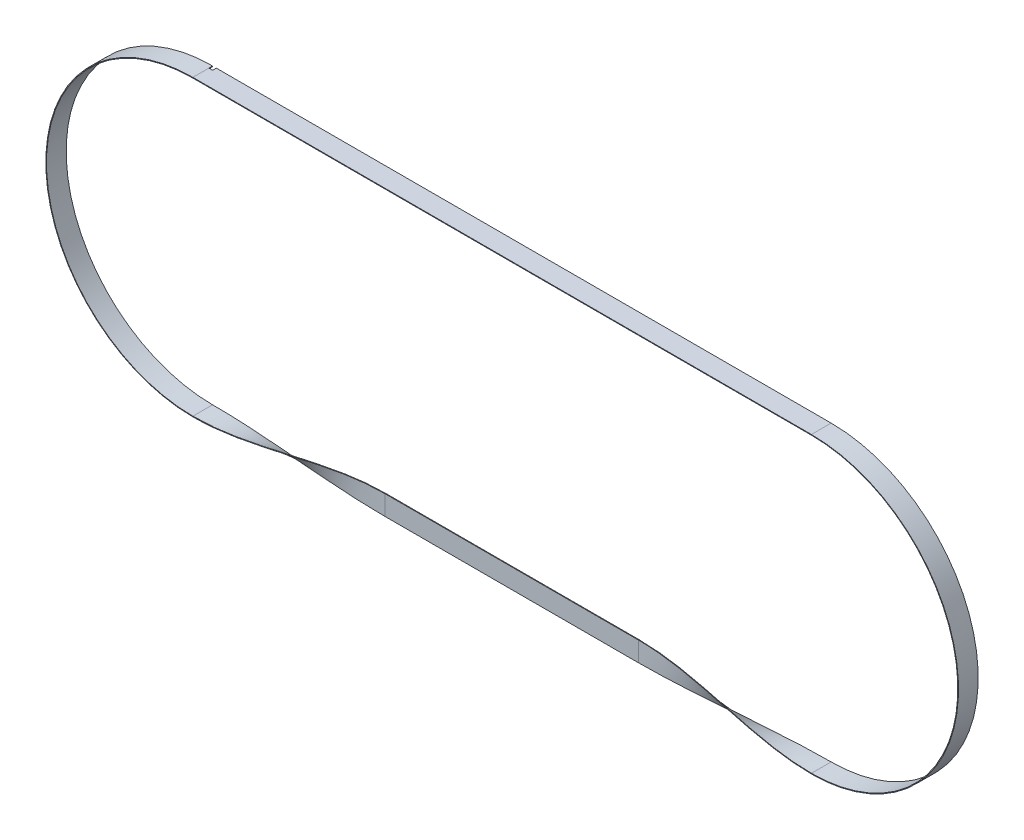
ISO-10303-21;
HEADER;
FILE_DESCRIPTION(('STEP AP214'),'2;1');
FILE_NAME('part.step','',(''),(''),'','','');
FILE_SCHEMA(('AUTOMOTIVE_DESIGN { 1 0 10303 214 1 1 1 1 }'));
ENDSEC;
DATA;
#1=APPLICATION_CONTEXT('core data for automotive mechanical design processes');
#2=APPLICATION_PROTOCOL_DEFINITION('international standard','automotive_design',2000,#1);
#3=PRODUCT_CONTEXT('',#1,'mechanical');
#4=PRODUCT('Part','Part','',(#3));
#5=PRODUCT_RELATED_PRODUCT_CATEGORY('part','',(#4));
#6=PRODUCT_DEFINITION_FORMATION('','',#4);
#7=PRODUCT_DEFINITION_CONTEXT('part definition',#1,'design');
#8=PRODUCT_DEFINITION('design','',#6,#7);
#9=PRODUCT_DEFINITION_SHAPE('','',#8);
#10=(LENGTH_UNIT() NAMED_UNIT(*) SI_UNIT(.MILLI.,.METRE.));
#11=(NAMED_UNIT(*) PLANE_ANGLE_UNIT() SI_UNIT($,.RADIAN.));
#12=(NAMED_UNIT(*) SI_UNIT($,.STERADIAN.) SOLID_ANGLE_UNIT());
#13=UNCERTAINTY_MEASURE_WITH_UNIT(LENGTH_MEASURE(1.E-05),#10,'distance_accuracy_value','');
#14=(GEOMETRIC_REPRESENTATION_CONTEXT(3) GLOBAL_UNCERTAINTY_ASSIGNED_CONTEXT((#13)) GLOBAL_UNIT_ASSIGNED_CONTEXT((#10,
#11,#12)) REPRESENTATION_CONTEXT('',''));
#15=CARTESIAN_POINT('',(0.,0.,0.));
#16=DIRECTION('',(0.,0.,1.));
#17=DIRECTION('',(1.,0.,0.));
#18=AXIS2_PLACEMENT_3D('',#15,#16,#17);
#19=CARTESIAN_POINT('',(423.499999999997,200.45,13.4999999999996));
#20=DIRECTION('',(0.,-1.,0.));
#21=DIRECTION('',(0.,0.,-1.));
#22=AXIS2_PLACEMENT_3D('',#19,#20,#21);
#23=PLANE('',#22);
#24=DIRECTION('',(0.,0.,1.));
#25=VECTOR('',#24,1.);
#26=CARTESIAN_POINT('',(-423.500000000003,200.45,13.4999999999996));
#27=LINE('',#26,#25);
#28=CARTESIAN_POINT('',(-423.499999999999,200.45,-8.40000000000041));
#29=VERTEX_POINT('',#28);
#30=CARTESIAN_POINT('',(-423.500000000003,200.45,13.4999999999996));
#31=VERTEX_POINT('',#30);
#32=EDGE_CURVE('E411',#29,#31,#27,.T.);
#33=ORIENTED_EDGE('',*,*,#32,.F.);
#34=DIRECTION('',(1.,0.,0.));
#35=VECTOR('',#34,1.);
#36=CARTESIAN_POINT('',(423.499999999997,200.45,-8.40000000000416));
#37=LINE('',#36,#35);
#38=CARTESIAN_POINT('',(-418.399999999999,200.45,-8.40000000000043));
#39=VERTEX_POINT('',#38);
#40=EDGE_CURVE('E468',#29,#39,#37,.T.);
#41=ORIENTED_EDGE('',*,*,#40,.T.);
#42=DIRECTION('',(0.,0.,-1.));
#43=VECTOR('',#42,1.);
#44=CARTESIAN_POINT('',(-418.399999999999,200.45,13.4999999999996));
#45=LINE('',#44,#43);
#46=CARTESIAN_POINT('',(-418.399999999999,200.45,-13.5000000000004));
#47=VERTEX_POINT('',#46);
#48=EDGE_CURVE('E669',#39,#47,#45,.T.);
#49=ORIENTED_EDGE('',*,*,#48,.T.);
#50=DIRECTION('',(-1.,0.,0.));
#51=VECTOR('',#50,1.);
#52=CARTESIAN_POINT('',(423.499999999997,200.45,-13.5000000000004));
#53=LINE('',#52,#51);
#54=CARTESIAN_POINT('',(423.499999999997,200.45,-13.5000000000004));
#55=VERTEX_POINT('',#54);
#56=EDGE_CURVE('E289',#55,#47,#53,.T.);
#57=ORIENTED_EDGE('',*,*,#56,.F.);
#58=DIRECTION('',(0.,0.,1.));
#59=VECTOR('',#58,1.);
#60=CARTESIAN_POINT('',(423.499999999997,200.45,13.4999999999996));
#61=LINE('',#60,#59);
#62=CARTESIAN_POINT('',(423.499999999997,200.45,13.4999999999996));
#63=VERTEX_POINT('',#62);
#64=EDGE_CURVE('E337',#55,#63,#61,.T.);
#65=ORIENTED_EDGE('',*,*,#64,.T.);
#66=DIRECTION('',(-1.,0.,0.));
#67=VECTOR('',#66,1.);
#68=CARTESIAN_POINT('',(423.499999999997,200.45,13.4999999999996));
#69=LINE('',#68,#67);
#70=EDGE_CURVE('E401',#63,#31,#69,.T.);
#71=ORIENTED_EDGE('',*,*,#70,.T.);
#72=EDGE_LOOP('',(#33,#41,#49,#57,#65,#71));
#73=FACE_BOUND('',#72,.T.);
#74=ADVANCED_FACE('F167',(#73),#23,.T.);
#75=CARTESIAN_POINT('',(423.499999999997,201.35,13.4999999999996));
#76=DIRECTION('',(0.,1.,0.));
#77=DIRECTION('',(0.,0.,1.));
#78=AXIS2_PLACEMENT_3D('',#75,#76,#77);
#79=PLANE('',#78);
#80=DIRECTION('',(0.,0.,1.));
#81=VECTOR('',#80,1.);
#82=CARTESIAN_POINT('',(-418.399999999999,201.35,13.4999999999996));
#83=LINE('',#82,#81);
#84=CARTESIAN_POINT('',(-418.399999999999,201.35,-13.5000000000004));
#85=VERTEX_POINT('',#84);
#86=CARTESIAN_POINT('',(-418.399999999999,201.35,-8.40000000000043));
#87=VERTEX_POINT('',#86);
#88=EDGE_CURVE('E182',#85,#87,#83,.T.);
#89=ORIENTED_EDGE('',*,*,#88,.T.);
#90=DIRECTION('',(-1.,0.,0.));
#91=VECTOR('',#90,1.);
#92=CARTESIAN_POINT('',(423.499999999997,201.35,-8.40000000000416));
#93=LINE('',#92,#91);
#94=CARTESIAN_POINT('',(-423.499999999999,201.35,-8.40000000000041));
#95=VERTEX_POINT('',#94);
#96=EDGE_CURVE('E12',#87,#95,#93,.T.);
#97=ORIENTED_EDGE('',*,*,#96,.T.);
#98=DIRECTION('',(0.,0.,-1.));
#99=VECTOR('',#98,1.);
#100=CARTESIAN_POINT('',(-423.500000000003,201.35,13.4999999999996));
#101=LINE('',#100,#99);
#102=CARTESIAN_POINT('',(-423.500000000003,201.35,13.4999999999996));
#103=VERTEX_POINT('',#102);
#104=EDGE_CURVE('E323',#103,#95,#101,.T.);
#105=ORIENTED_EDGE('',*,*,#104,.F.);
#106=DIRECTION('',(-1.,0.,0.));
#107=VECTOR('',#106,1.);
#108=CARTESIAN_POINT('',(423.499999999997,201.35,13.4999999999996));
#109=LINE('',#108,#107);
#110=CARTESIAN_POINT('',(423.499999999997,201.35,13.4999999999996));
#111=VERTEX_POINT('',#110);
#112=EDGE_CURVE('E404',#111,#103,#109,.T.);
#113=ORIENTED_EDGE('',*,*,#112,.F.);
#114=DIRECTION('',(0.,0.,-1.));
#115=VECTOR('',#114,1.);
#116=CARTESIAN_POINT('',(423.499999999997,201.35,13.4999999999996));
#117=LINE('',#116,#115);
#118=CARTESIAN_POINT('',(423.499999999997,201.35,-13.5000000000004));
#119=VERTEX_POINT('',#118);
#120=EDGE_CURVE('E319',#111,#119,#117,.T.);
#121=ORIENTED_EDGE('',*,*,#120,.T.);
#122=DIRECTION('',(-1.,0.,0.));
#123=VECTOR('',#122,1.);
#124=CARTESIAN_POINT('',(423.499999999997,201.35,-13.5000000000004));
#125=LINE('',#124,#123);
#126=EDGE_CURVE('E407',#119,#85,#125,.T.);
#127=ORIENTED_EDGE('',*,*,#126,.T.);
#128=EDGE_LOOP('',(#89,#97,#105,#113,#121,#127));
#129=FACE_BOUND('',#128,.T.);
#130=ADVANCED_FACE('F630',(#129),#79,.T.);
#131=CARTESIAN_POINT('',(423.499999999997,201.35,-13.5000000000004));
#132=DIRECTION('',(0.,0.,1.));
#133=DIRECTION('',(1.,0.,0.));
#134=AXIS2_PLACEMENT_3D('',#131,#132,#133);
#135=PLANE('',#134);
#136=DIRECTION('',(0.,1.,0.));
#137=VECTOR('',#136,1.);
#138=CARTESIAN_POINT('',(-423.499999999999,201.35,-13.5000000000004));
#139=LINE('',#138,#137);
#140=CARTESIAN_POINT('',(-423.499999999999,200.45,-13.5000000000004));
#141=VERTEX_POINT('',#140);
#142=CARTESIAN_POINT('',(-423.499999999999,201.35,-13.5000000000004));
#143=VERTEX_POINT('',#142);
#144=EDGE_CURVE('E175',#141,#143,#139,.T.);
#145=ORIENTED_EDGE('',*,*,#144,.F.);
#146=CARTESIAN_POINT('',(-423.5,0.,-13.5000000000004));
#147=DIRECTION('',(0.,0.,1.));
#148=DIRECTION('',(1.,0.,0.));
#149=AXIS2_PLACEMENT_3D('',#146,#147,#148);
#150=CIRCLE('',#149,200.45);
#151=CARTESIAN_POINT('',(-423.499999999999,-200.449999999999,-13.4999999999823));
#152=VERTEX_POINT('',#151);
#153=EDGE_CURVE('E285',#141,#152,#150,.T.);
#154=ORIENTED_EDGE('',*,*,#153,.T.);
#155=DIRECTION('',(0.,1.,0.));
#156=VECTOR('',#155,1.);
#157=CARTESIAN_POINT('',(-423.499999999997,201.35,-13.5000000000004));
#158=LINE('',#157,#156);
#159=CARTESIAN_POINT('',(-423.499999999999,-201.349999999999,-13.5000000000004));
#160=VERTEX_POINT('',#159);
#161=EDGE_CURVE('E282',#160,#152,#158,.T.);
#162=ORIENTED_EDGE('',*,*,#161,.F.);
#163=CARTESIAN_POINT('',(-423.5,0.,-13.5000000000004));
#164=DIRECTION('',(0.,0.,1.));
#165=DIRECTION('',(1.,0.,0.));
#166=AXIS2_PLACEMENT_3D('',#163,#164,#165);
#167=CIRCLE('',#166,201.35);
#168=EDGE_CURVE('E267',#143,#160,#167,.T.);
#169=ORIENTED_EDGE('',*,*,#168,.F.);
#170=EDGE_LOOP('',(#145,#154,#162,#169));
#171=FACE_BOUND('',#170,.T.);
#172=ADVANCED_FACE('F284',(#171),#135,.F.);
#173=DIRECTION('',(0.,-1.,0.));
#174=VECTOR('',#173,1.);
#175=CARTESIAN_POINT('',(-418.399999999999,201.35,-13.5000000000004));
#176=LINE('',#175,#174);
#177=EDGE_CURVE('E380',#85,#47,#176,.T.);
#178=ORIENTED_EDGE('',*,*,#177,.F.);
#179=ORIENTED_EDGE('',*,*,#126,.F.);
#180=CARTESIAN_POINT('',(423.5,0.,-13.5000000000004));
#181=DIRECTION('',(0.,0.,-1.));
#182=DIRECTION('',(-1.,0.,0.));
#183=AXIS2_PLACEMENT_3D('',#180,#181,#182);
#184=CIRCLE('',#183,201.35);
#185=CARTESIAN_POINT('',(423.5,-201.35,-13.5000000000004));
#186=VERTEX_POINT('',#185);
#187=EDGE_CURVE('E320',#119,#186,#184,.T.);
#188=ORIENTED_EDGE('',*,*,#187,.T.);
#189=DIRECTION('',(0.,1.,0.));
#190=VECTOR('',#189,1.);
#191=CARTESIAN_POINT('',(423.5,201.35,-13.5000000000004));
#192=LINE('',#191,#190);
#193=CARTESIAN_POINT('',(423.5,-200.45,-13.5000000000004));
#194=VERTEX_POINT('',#193);
#195=EDGE_CURVE('E216',#186,#194,#192,.T.);
#196=ORIENTED_EDGE('',*,*,#195,.T.);
#197=CARTESIAN_POINT('',(423.5,0.,-13.5000000000004));
#198=DIRECTION('',(0.,0.,-1.));
#199=DIRECTION('',(-1.,0.,0.));
#200=AXIS2_PLACEMENT_3D('',#197,#198,#199);
#201=CIRCLE('',#200,200.45);
#202=EDGE_CURVE('E316',#55,#194,#201,.T.);
#203=ORIENTED_EDGE('',*,*,#202,.F.);
#204=ORIENTED_EDGE('',*,*,#56,.T.);
#205=EDGE_LOOP('',(#178,#179,#188,#196,#203,#204));
#206=FACE_BOUND('',#205,.T.);
#207=ADVANCED_FACE('F629',(#206),#135,.F.);
#208=CARTESIAN_POINT('',(-423.5,0.,0.));
#209=DIRECTION('',(0.,0.,1.));
#210=DIRECTION('',(1.,0.,0.));
#211=AXIS2_PLACEMENT_3D('',#208,#209,#210);
#212=CYLINDRICAL_SURFACE('',#211,200.45);
#213=EDGE_CURVE('E390',#141,#29,#27,.T.);
#214=ORIENTED_EDGE('',*,*,#213,.T.);
#215=ORIENTED_EDGE('',*,*,#32,.T.);
#216=CARTESIAN_POINT('',(-423.5,0.,13.4999999999996));
#217=DIRECTION('',(0.,0.,1.));
#218=DIRECTION('',(1.,0.,0.));
#219=AXIS2_PLACEMENT_3D('',#216,#217,#218);
#220=CIRCLE('',#219,200.45);
#221=CARTESIAN_POINT('',(-423.499999999999,-200.449999999999,13.4999999999999));
#222=VERTEX_POINT('',#221);
#223=EDGE_CURVE('E395',#31,#222,#220,.T.);
#224=ORIENTED_EDGE('',*,*,#223,.T.);
#225=DIRECTION('',(0.,0.,1.));
#226=VECTOR('',#225,1.);
#227=CARTESIAN_POINT('',(-423.499999999997,-200.45,0.));
#228=LINE('',#227,#226);
#229=EDGE_CURVE('E191',#152,#222,#228,.T.);
#230=ORIENTED_EDGE('',*,*,#229,.F.);
#231=ORIENTED_EDGE('',*,*,#153,.F.);
#232=EDGE_LOOP('',(#214,#215,#224,#230,#231));
#233=FACE_BOUND('',#232,.T.);
#234=ADVANCED_FACE('F169',(#233),#212,.F.);
#235=CARTESIAN_POINT('',(-423.5,0.,0.));
#236=DIRECTION('',(0.,0.,1.));
#237=DIRECTION('',(1.,0.,0.));
#238=AXIS2_PLACEMENT_3D('',#235,#236,#237);
#239=CYLINDRICAL_SURFACE('',#238,201.35);
#240=ORIENTED_EDGE('',*,*,#104,.T.);
#241=DIRECTION('',(0.,0.,-1.));
#242=VECTOR('',#241,1.);
#243=CARTESIAN_POINT('',(-423.499999999999,201.35,13.4999999999996));
#244=LINE('',#243,#242);
#245=EDGE_CURVE('E276',#95,#143,#244,.T.);
#246=ORIENTED_EDGE('',*,*,#245,.T.);
#247=ORIENTED_EDGE('',*,*,#168,.T.);
#248=DIRECTION('',(0.,0.,1.));
#249=VECTOR('',#248,1.);
#250=CARTESIAN_POINT('',(-423.499999999997,-201.35,0.));
#251=LINE('',#250,#249);
#252=CARTESIAN_POINT('',(-423.499999999999,-201.349999999999,13.4999999999999));
#253=VERTEX_POINT('',#252);
#254=EDGE_CURVE('E272',#253,#160,#251,.F.);
#255=ORIENTED_EDGE('',*,*,#254,.F.);
#256=CARTESIAN_POINT('',(-423.5,0.,13.4999999999996));
#257=DIRECTION('',(0.,0.,1.));
#258=DIRECTION('',(1.,0.,0.));
#259=AXIS2_PLACEMENT_3D('',#256,#257,#258);
#260=CIRCLE('',#259,201.35);
#261=EDGE_CURVE('E279',#103,#253,#260,.T.);
#262=ORIENTED_EDGE('',*,*,#261,.F.);
#263=EDGE_LOOP('',(#240,#246,#247,#255,#262));
#264=FACE_BOUND('',#263,.T.);
#265=ADVANCED_FACE('F270',(#264),#239,.T.);
#266=CARTESIAN_POINT('',(423.5,0.,0.));
#267=DIRECTION('',(0.,0.,-1.));
#268=DIRECTION('',(-1.,0.,0.));
#269=AXIS2_PLACEMENT_3D('',#266,#267,#268);
#270=CYLINDRICAL_SURFACE('',#269,201.35);
#271=CARTESIAN_POINT('',(423.5,0.,13.4999999999996));
#272=DIRECTION('',(0.,0.,-1.));
#273=DIRECTION('',(-1.,0.,0.));
#274=AXIS2_PLACEMENT_3D('',#271,#272,#273);
#275=CIRCLE('',#274,201.35);
#276=CARTESIAN_POINT('',(423.5,-201.35,13.4999999999996));
#277=VERTEX_POINT('',#276);
#278=EDGE_CURVE('E315',#111,#277,#275,.T.);
#279=ORIENTED_EDGE('',*,*,#278,.T.);
#280=DIRECTION('',(0.,0.,-1.));
#281=VECTOR('',#280,1.);
#282=CARTESIAN_POINT('',(423.5,-201.35,0.));
#283=LINE('',#282,#281);
#284=EDGE_CURVE('E334',#277,#186,#283,.T.);
#285=ORIENTED_EDGE('',*,*,#284,.T.);
#286=ORIENTED_EDGE('',*,*,#187,.F.);
#287=ORIENTED_EDGE('',*,*,#120,.F.);
#288=EDGE_LOOP('',(#279,#285,#286,#287));
#289=FACE_BOUND('',#288,.T.);
#290=ADVANCED_FACE('F637',(#289),#270,.T.);
#291=CARTESIAN_POINT('',(423.499999999997,201.35,13.4999999999996));
#292=DIRECTION('',(0.,0.,-1.));
#293=DIRECTION('',(-1.,0.,0.));
#294=AXIS2_PLACEMENT_3D('',#291,#292,#293);
#295=PLANE('',#294);
#296=CARTESIAN_POINT('',(423.5,0.,13.4999999999996));
#297=DIRECTION('',(0.,0.,-1.));
#298=DIRECTION('',(-1.,0.,0.));
#299=AXIS2_PLACEMENT_3D('',#296,#297,#298);
#300=CIRCLE('',#299,200.45);
#301=CARTESIAN_POINT('',(423.5,-200.45,13.4999999999996));
#302=VERTEX_POINT('',#301);
#303=EDGE_CURVE('E312',#63,#302,#300,.T.);
#304=ORIENTED_EDGE('',*,*,#303,.T.);
#305=DIRECTION('',(0.,1.,0.));
#306=VECTOR('',#305,1.);
#307=CARTESIAN_POINT('',(423.5,201.35,13.4999999999996));
#308=LINE('',#307,#306);
#309=EDGE_CURVE('E331',#302,#277,#308,.F.);
#310=ORIENTED_EDGE('',*,*,#309,.T.);
#311=ORIENTED_EDGE('',*,*,#278,.F.);
#312=ORIENTED_EDGE('',*,*,#112,.T.);
#313=ORIENTED_EDGE('',*,*,#261,.T.);
#314=DIRECTION('',(0.,1.,0.));
#315=VECTOR('',#314,1.);
#316=CARTESIAN_POINT('',(-423.499999999997,201.35,13.4999999999996));
#317=LINE('',#316,#315);
#318=EDGE_CURVE('E305',#222,#253,#317,.F.);
#319=ORIENTED_EDGE('',*,*,#318,.F.);
#320=ORIENTED_EDGE('',*,*,#223,.F.);
#321=ORIENTED_EDGE('',*,*,#70,.F.);
#322=EDGE_LOOP('',(#304,#310,#311,#312,#313,#319,#320,#321));
#323=FACE_BOUND('',#322,.T.);
#324=ADVANCED_FACE('F633',(#323),#295,.F.);
#325=CARTESIAN_POINT('',(423.5,0.,0.));
#326=DIRECTION('',(0.,0.,-1.));
#327=DIRECTION('',(-1.,0.,0.));
#328=AXIS2_PLACEMENT_3D('',#325,#326,#327);
#329=CYLINDRICAL_SURFACE('',#328,200.45);
#330=ORIENTED_EDGE('',*,*,#64,.F.);
#331=ORIENTED_EDGE('',*,*,#202,.T.);
#332=DIRECTION('',(0.,0.,-1.));
#333=VECTOR('',#332,1.);
#334=CARTESIAN_POINT('',(423.5,-200.45,0.));
#335=LINE('',#334,#333);
#336=EDGE_CURVE('E327',#194,#302,#335,.F.);
#337=ORIENTED_EDGE('',*,*,#336,.T.);
#338=ORIENTED_EDGE('',*,*,#303,.F.);
#339=EDGE_LOOP('',(#330,#331,#337,#338));
#340=FACE_BOUND('',#339,.T.);
#341=ADVANCED_FACE('F593',(#340),#329,.F.);
#342=CARTESIAN_POINT('',(-173.500000000001,-173.900000000003,0.45));
#343=CARTESIAN_POINT('',(-257.446944223386,-173.900000000003,0.45));
#344=CARTESIAN_POINT('',(-339.553055776611,-201.349999999999,13.4999999999996));
#345=CARTESIAN_POINT('',(-423.499999999997,-201.35,13.4999999999996));
#346=CARTESIAN_POINT('',(-173.500000000001,-173.900000000003,0.15));
#347=CARTESIAN_POINT('',(-257.441583181179,-173.900000000003,0.15));
#348=CARTESIAN_POINT('',(-339.558416818819,-201.049999999999,13.4999999999996));
#349=CARTESIAN_POINT('',(-423.499999999997,-201.05,13.4999999999996));
#350=CARTESIAN_POINT('',(-173.500000000001,-173.900000000003,-0.15));
#351=CARTESIAN_POINT('',(-257.436222138972,-173.900000000003,-0.15));
#352=CARTESIAN_POINT('',(-339.563777861026,-200.749999999999,13.4999999999996));
#353=CARTESIAN_POINT('',(-423.499999999997,-200.75,13.4999999999996));
#354=CARTESIAN_POINT('',(-173.500000000001,-173.900000000003,-0.449999999999999));
#355=CARTESIAN_POINT('',(-257.430861096764,-173.900000000003,-0.449999999999999));
#356=CARTESIAN_POINT('',(-339.569138903234,-200.449999999999,13.4999999999996));
#357=CARTESIAN_POINT('',(-423.499999999997,-200.45,13.4999999999996));
#358=B_SPLINE_SURFACE_WITH_KNOTS('',3,3,((#342,#343,#344,#345),(#346,#347,#348,#349),(#350,#351,
#352,#353),(#354,#355,#356,#357)),.UNSPECIFIED.,.F.,.F.,.F.,(4,4),(4,4),(0.,1.),(0.,1.),.UNSPECIFIED.);
#359=DIRECTION('',(0.,0.,1.));
#360=VECTOR('',#359,1.);
#361=CARTESIAN_POINT('',(-173.500000000001,-173.900000000003,0.45));
#362=LINE('',#361,#360);
#363=CARTESIAN_POINT('',(-173.500000000001,-173.900000000003,-0.449999999999999));
#364=VERTEX_POINT('',#363);
#365=CARTESIAN_POINT('',(-173.500000000001,-173.900000000003,0.45));
#366=VERTEX_POINT('',#365);
#367=EDGE_CURVE('E328',#364,#366,#362,.T.);
#368=CARTESIAN_POINT('',(-173.500000000001,-173.900000000003,-0.449999999999999));
#369=CARTESIAN_POINT('',(-257.430861096764,-173.900000000003,-0.449999999999999));
#370=CARTESIAN_POINT('',(-339.569138903234,-200.449999999999,13.4999999999996));
#371=CARTESIAN_POINT('',(-423.499999999997,-200.45,13.4999999999996));
#372=B_SPLINE_CURVE_WITH_KNOTS('',3,(#368,#369,#370,#371),.UNSPECIFIED.,.F.,.F.,(4,4),(0.,1.),.UNSPECIFIED.);
#373=EDGE_CURVE('E366',#364,#222,#372,.T.);
#374=CARTESIAN_POINT('',(-173.500000000001,-173.900000000003,0.45));
#375=CARTESIAN_POINT('',(-257.446944223386,-173.900000000003,0.45));
#376=CARTESIAN_POINT('',(-339.553055776611,-201.349999999999,13.4999999999996));
#377=CARTESIAN_POINT('',(-423.499999999997,-201.35,13.4999999999996));
#378=B_SPLINE_CURVE_WITH_KNOTS('',3,(#374,#375,#376,#377),.UNSPECIFIED.,.F.,.F.,(4,4),(0.,1.),.UNSPECIFIED.);
#379=EDGE_CURVE('E304',#253,#366,#378,.F.);
#380=ORIENTED_EDGE('',*,*,#367,.F.);
#381=ORIENTED_EDGE('',*,*,#373,.T.);
#382=ORIENTED_EDGE('',*,*,#318,.T.);
#383=ORIENTED_EDGE('',*,*,#379,.T.);
#384=EDGE_LOOP('',(#380,#381,#382,#383));
#385=FACE_BOUND('',#384,.T.);
#386=ADVANCED_FACE('F449',(#385),#358,.T.);
#387=CARTESIAN_POINT('',(-173.500000000001,-173.900000000003,-0.449999999999999));
#388=CARTESIAN_POINT('',(-257.430861096764,-173.900000000003,-0.449999999999999));
#389=CARTESIAN_POINT('',(-339.569138903234,-200.449999999999,13.4999999999996));
#390=CARTESIAN_POINT('',(-423.499999999997,-200.45,13.4999999999996));
#391=CARTESIAN_POINT('',(-173.500000000001,-182.900000000003,-0.450000000000001));
#392=CARTESIAN_POINT('',(-257.269549369072,-182.900000000003,-0.450000000000001));
#393=CARTESIAN_POINT('',(-339.730450630926,-200.449999999999,4.49999999999957));
#394=CARTESIAN_POINT('',(-423.499999999997,-200.45,4.49999999999957));
#395=CARTESIAN_POINT('',(-173.500000000001,-191.900000000003,-0.450000000000002));
#396=CARTESIAN_POINT('',(-257.108237641379,-191.900000000003,-0.450000000000002));
#397=CARTESIAN_POINT('',(-339.891762358618,-200.449999999999,-4.50000000000043));
#398=CARTESIAN_POINT('',(-423.499999999997,-200.45,-4.50000000000043));
#399=CARTESIAN_POINT('',(-173.500000000001,-200.900000000003,-0.450000000000004));
#400=CARTESIAN_POINT('',(-256.946925913687,-200.900000000003,-0.450000000000004));
#401=CARTESIAN_POINT('',(-340.053074086311,-200.449999999999,-13.5000000000004));
#402=CARTESIAN_POINT('',(-423.499999999997,-200.45,-13.5000000000004));
#403=B_SPLINE_SURFACE_WITH_KNOTS('',3,3,((#387,#388,#389,#390),(#391,#392,#393,#394),(#395,#396,
#397,#398),(#399,#400,#401,#402)),.UNSPECIFIED.,.F.,.F.,.F.,(4,4),(4,4),(0.,1.),(0.,1.),.UNSPECIFIED.);
#404=DIRECTION('',(0.,1.,0.));
#405=VECTOR('',#404,1.);
#406=CARTESIAN_POINT('',(-173.500000000001,-173.900000000003,-0.449999999999999));
#407=LINE('',#406,#405);
#408=CARTESIAN_POINT('',(-173.500000000001,-200.900000000003,-0.450000000000004));
#409=VERTEX_POINT('',#408);
#410=EDGE_CURVE('E363',#409,#364,#407,.T.);
#411=CARTESIAN_POINT('',(-173.500000000001,-200.900000000003,-0.450000000000004));
#412=CARTESIAN_POINT('',(-256.946925913687,-200.900000000003,-0.450000000000004));
#413=CARTESIAN_POINT('',(-340.053074086311,-200.449999999999,-13.5000000000004));
#414=CARTESIAN_POINT('',(-423.499999999997,-200.45,-13.5000000000004));
#415=B_SPLINE_CURVE_WITH_KNOTS('',3,(#411,#412,#413,#414),.UNSPECIFIED.,.F.,.F.,(4,4),(0.,1.),.UNSPECIFIED.);
#416=EDGE_CURVE('E298',#409,#152,#415,.T.);
#417=ORIENTED_EDGE('',*,*,#410,.F.);
#418=ORIENTED_EDGE('',*,*,#416,.T.);
#419=ORIENTED_EDGE('',*,*,#229,.T.);
#420=ORIENTED_EDGE('',*,*,#373,.F.);
#421=EDGE_LOOP('',(#417,#418,#419,#420));
#422=FACE_BOUND('',#421,.T.);
#423=ADVANCED_FACE('F592',(#422),#403,.T.);
#424=CARTESIAN_POINT('',(-173.500000000001,-200.900000000003,0.450000000000004));
#425=CARTESIAN_POINT('',(-256.963102293435,-200.900000000003,0.450000000000004));
#426=CARTESIAN_POINT('',(-340.036897706563,-201.349999999999,-13.5000000000004));
#427=CARTESIAN_POINT('',(-423.499999999997,-201.35,-13.5000000000004));
#428=CARTESIAN_POINT('',(-173.500000000001,-191.900000000003,0.450000000000003));
#429=CARTESIAN_POINT('',(-257.124382936752,-191.900000000003,0.450000000000003));
#430=CARTESIAN_POINT('',(-339.875617063246,-201.349999999999,-4.50000000000043));
#431=CARTESIAN_POINT('',(-423.499999999997,-201.35,-4.50000000000043));
#432=CARTESIAN_POINT('',(-173.500000000001,-182.900000000003,0.450000000000001));
#433=CARTESIAN_POINT('',(-257.285663580069,-182.900000000003,0.450000000000001));
#434=CARTESIAN_POINT('',(-339.714336419929,-201.349999999999,4.49999999999957));
#435=CARTESIAN_POINT('',(-423.499999999997,-201.35,4.49999999999957));
#436=CARTESIAN_POINT('',(-173.500000000001,-173.900000000003,0.45));
#437=CARTESIAN_POINT('',(-257.446944223386,-173.900000000003,0.45));
#438=CARTESIAN_POINT('',(-339.553055776611,-201.349999999999,13.4999999999996));
#439=CARTESIAN_POINT('',(-423.499999999997,-201.35,13.4999999999996));
#440=B_SPLINE_SURFACE_WITH_KNOTS('',3,3,((#424,#425,#426,#427),(#428,#429,#430,#431),(#432,#433,
#434,#435),(#436,#437,#438,#439)),.UNSPECIFIED.,.F.,.F.,.F.,(4,4),(4,4),(0.,1.),(0.,1.),.UNSPECIFIED.);
#441=DIRECTION('',(0.,-1.,0.));
#442=VECTOR('',#441,1.);
#443=CARTESIAN_POINT('',(-173.500000000001,-173.900000000003,0.45));
#444=LINE('',#443,#442);
#445=CARTESIAN_POINT('',(-173.500000000001,-200.900000000003,0.450000000000004));
#446=VERTEX_POINT('',#445);
#447=EDGE_CURVE('E370',#366,#446,#444,.T.);
#448=CARTESIAN_POINT('',(-173.500000000001,-200.900000000003,0.450000000000004));
#449=CARTESIAN_POINT('',(-256.963102293435,-200.900000000003,0.450000000000004));
#450=CARTESIAN_POINT('',(-340.036897706563,-201.349999999999,-13.5000000000004));
#451=CARTESIAN_POINT('',(-423.499999999997,-201.35,-13.5000000000004));
#452=B_SPLINE_CURVE_WITH_KNOTS('',3,(#448,#449,#450,#451),.UNSPECIFIED.,.F.,.F.,(4,4),(0.,1.),.UNSPECIFIED.);
#453=EDGE_CURVE('E292',#446,#160,#452,.T.);
#454=ORIENTED_EDGE('',*,*,#447,.F.);
#455=ORIENTED_EDGE('',*,*,#379,.F.);
#456=ORIENTED_EDGE('',*,*,#254,.T.);
#457=ORIENTED_EDGE('',*,*,#453,.F.);
#458=EDGE_LOOP('',(#454,#455,#456,#457));
#459=FACE_BOUND('',#458,.T.);
#460=ADVANCED_FACE('F302',(#459),#440,.T.);
#461=CARTESIAN_POINT('',(-173.500000000001,-200.900000000003,-0.450000000000004));
#462=CARTESIAN_POINT('',(-256.946925913687,-200.900000000003,-0.450000000000004));
#463=CARTESIAN_POINT('',(-340.053074086311,-200.449999999999,-13.5000000000004));
#464=CARTESIAN_POINT('',(-423.499999999997,-200.45,-13.5000000000004));
#465=CARTESIAN_POINT('',(-173.500000000001,-200.900000000003,-0.150000000000001));
#466=CARTESIAN_POINT('',(-256.95231804027,-200.900000000003,-0.150000000000001));
#467=CARTESIAN_POINT('',(-340.047681959728,-200.749999999999,-13.5000000000004));
#468=CARTESIAN_POINT('',(-423.499999999997,-200.75,-13.5000000000004));
#469=CARTESIAN_POINT('',(-173.500000000001,-200.900000000003,0.150000000000001));
#470=CARTESIAN_POINT('',(-256.957710166852,-200.900000000003,0.150000000000001));
#471=CARTESIAN_POINT('',(-340.042289833146,-201.049999999999,-13.5000000000004));
#472=CARTESIAN_POINT('',(-423.499999999997,-201.05,-13.5000000000004));
#473=CARTESIAN_POINT('',(-173.500000000001,-200.900000000003,0.450000000000004));
#474=CARTESIAN_POINT('',(-256.963102293435,-200.900000000003,0.450000000000004));
#475=CARTESIAN_POINT('',(-340.036897706563,-201.349999999999,-13.5000000000004));
#476=CARTESIAN_POINT('',(-423.499999999997,-201.35,-13.5000000000004));
#477=B_SPLINE_SURFACE_WITH_KNOTS('',3,3,((#461,#462,#463,#464),(#465,#466,#467,#468),(#469,#470,
#471,#472),(#473,#474,#475,#476)),.UNSPECIFIED.,.F.,.F.,.F.,(4,4),(4,4),(0.,1.),(0.,1.),.UNSPECIFIED.);
#478=DIRECTION('',(0.,0.,-1.));
#479=VECTOR('',#478,1.);
#480=CARTESIAN_POINT('',(-173.500000000001,-200.900000000003,0.450000000000004));
#481=LINE('',#480,#479);
#482=EDGE_CURVE('E295',#446,#409,#481,.T.);
#483=ORIENTED_EDGE('',*,*,#482,.F.);
#484=ORIENTED_EDGE('',*,*,#453,.T.);
#485=ORIENTED_EDGE('',*,*,#161,.T.);
#486=ORIENTED_EDGE('',*,*,#416,.F.);
#487=EDGE_LOOP('',(#483,#484,#485,#486));
#488=FACE_BOUND('',#487,.T.);
#489=ADVANCED_FACE('F293',(#488),#477,.T.);
#490=CARTESIAN_POINT('',(423.5,-201.35,-13.5000000000004));
#491=CARTESIAN_POINT('',(340.036897706565,-201.35,-13.5000000000004));
#492=CARTESIAN_POINT('',(256.963102293435,-200.9,0.450000000000004));
#493=CARTESIAN_POINT('',(173.5,-200.9,0.450000000000004));
#494=CARTESIAN_POINT('',(423.5,-201.35,-4.50000000000043));
#495=CARTESIAN_POINT('',(339.875617063247,-201.35,-4.50000000000043));
#496=CARTESIAN_POINT('',(257.124382936753,-191.9,0.450000000000001));
#497=CARTESIAN_POINT('',(173.5,-191.9,0.450000000000001));
#498=CARTESIAN_POINT('',(423.5,-201.35,4.49999999999957));
#499=CARTESIAN_POINT('',(339.71433641993,-201.35,4.49999999999957));
#500=CARTESIAN_POINT('',(257.28566358007,-182.9,0.449999999999999));
#501=CARTESIAN_POINT('',(173.5,-182.9,0.449999999999999));
#502=CARTESIAN_POINT('',(423.5,-201.35,13.4999999999996));
#503=CARTESIAN_POINT('',(339.553055776613,-201.35,13.4999999999996));
#504=CARTESIAN_POINT('',(257.446944223387,-173.9,0.449999999999996));
#505=CARTESIAN_POINT('',(173.5,-173.9,0.449999999999996));
#506=B_SPLINE_SURFACE_WITH_KNOTS('',3,3,((#490,#491,#492,#493),(#494,#495,#496,#497),(#498,#499,
#500,#501),(#502,#503,#504,#505)),.UNSPECIFIED.,.F.,.F.,.F.,(4,4),(4,4),(0.,1.),(0.,1.),.UNSPECIFIED.);
#507=CARTESIAN_POINT('',(423.5,-201.35,13.4999999999996));
#508=CARTESIAN_POINT('',(339.553055776613,-201.35,13.4999999999996));
#509=CARTESIAN_POINT('',(257.446944223387,-173.9,0.449999999999996));
#510=CARTESIAN_POINT('',(173.5,-173.9,0.449999999999996));
#511=B_SPLINE_CURVE_WITH_KNOTS('',3,(#507,#508,#509,#510),.UNSPECIFIED.,.F.,.F.,(4,4),(0.,1.),.UNSPECIFIED.);
#512=CARTESIAN_POINT('',(173.5,-173.9,0.449999999999996));
#513=VERTEX_POINT('',#512);
#514=EDGE_CURVE('E299',#277,#513,#511,.T.);
#515=DIRECTION('',(0.,1.,0.));
#516=VECTOR('',#515,1.);
#517=CARTESIAN_POINT('',(173.5,-200.9,0.450000000000004));
#518=LINE('',#517,#516);
#519=CARTESIAN_POINT('',(173.5,-200.9,0.450000000000004));
#520=VERTEX_POINT('',#519);
#521=EDGE_CURVE('E359',#520,#513,#518,.T.);
#522=CARTESIAN_POINT('',(423.5,-201.35,-13.5000000000004));
#523=CARTESIAN_POINT('',(340.036897706565,-201.35,-13.5000000000004));
#524=CARTESIAN_POINT('',(256.963102293435,-200.9,0.450000000000004));
#525=CARTESIAN_POINT('',(173.5,-200.9,0.450000000000004));
#526=B_SPLINE_CURVE_WITH_KNOTS('',3,(#522,#523,#524,#525),.UNSPECIFIED.,.F.,.F.,(4,4),(0.,1.),.UNSPECIFIED.);
#527=EDGE_CURVE('E518',#520,#186,#526,.F.);
#528=ORIENTED_EDGE('',*,*,#284,.F.);
#529=ORIENTED_EDGE('',*,*,#514,.T.);
#530=ORIENTED_EDGE('',*,*,#521,.F.);
#531=ORIENTED_EDGE('',*,*,#527,.T.);
#532=EDGE_LOOP('',(#528,#529,#530,#531));
#533=FACE_BOUND('',#532,.T.);
#534=ADVANCED_FACE('F501',(#533),#506,.T.);
#535=CARTESIAN_POINT('',(423.5,-201.35,13.4999999999996));
#536=CARTESIAN_POINT('',(339.553055776613,-201.35,13.4999999999996));
#537=CARTESIAN_POINT('',(257.446944223387,-173.9,0.449999999999996));
#538=CARTESIAN_POINT('',(173.5,-173.9,0.449999999999996));
#539=CARTESIAN_POINT('',(423.5,-201.05,13.4999999999996));
#540=CARTESIAN_POINT('',(339.55841681882,-201.05,13.4999999999996));
#541=CARTESIAN_POINT('',(257.44158318118,-173.9,0.149999999999996));
#542=CARTESIAN_POINT('',(173.5,-173.9,0.149999999999996));
#543=CARTESIAN_POINT('',(423.5,-200.75,13.4999999999996));
#544=CARTESIAN_POINT('',(339.563777861028,-200.75,13.4999999999996));
#545=CARTESIAN_POINT('',(257.436222138972,-173.9,-0.150000000000004));
#546=CARTESIAN_POINT('',(173.5,-173.9,-0.150000000000004));
#547=CARTESIAN_POINT('',(423.5,-200.45,13.4999999999996));
#548=CARTESIAN_POINT('',(339.569138903235,-200.45,13.4999999999996));
#549=CARTESIAN_POINT('',(257.430861096765,-173.9,-0.450000000000004));
#550=CARTESIAN_POINT('',(173.5,-173.9,-0.450000000000004));
#551=B_SPLINE_SURFACE_WITH_KNOTS('',3,3,((#535,#536,#537,#538),(#539,#540,#541,#542),(#543,#544,
#545,#546),(#547,#548,#549,#550)),.UNSPECIFIED.,.F.,.F.,.F.,(4,4),(4,4),(0.,1.),(0.,1.),.UNSPECIFIED.);
#552=CARTESIAN_POINT('',(423.5,-200.45,13.4999999999996));
#553=CARTESIAN_POINT('',(339.569138903235,-200.45,13.4999999999996));
#554=CARTESIAN_POINT('',(257.430861096765,-173.9,-0.450000000000004));
#555=CARTESIAN_POINT('',(173.5,-173.9,-0.450000000000004));
#556=B_SPLINE_CURVE_WITH_KNOTS('',3,(#552,#553,#554,#555),.UNSPECIFIED.,.F.,.F.,(4,4),(0.,1.),.UNSPECIFIED.);
#557=CARTESIAN_POINT('',(173.5,-173.9,-0.450000000000004));
#558=VERTEX_POINT('',#557);
#559=EDGE_CURVE('E511',#302,#558,#556,.T.);
#560=DIRECTION('',(0.,0.,-1.));
#561=VECTOR('',#560,1.);
#562=CARTESIAN_POINT('',(173.5,-173.9,-0.450000000000004));
#563=LINE('',#562,#561);
#564=EDGE_CURVE('E225',#513,#558,#563,.T.);
#565=ORIENTED_EDGE('',*,*,#309,.F.);
#566=ORIENTED_EDGE('',*,*,#559,.T.);
#567=ORIENTED_EDGE('',*,*,#564,.F.);
#568=ORIENTED_EDGE('',*,*,#514,.F.);
#569=EDGE_LOOP('',(#565,#566,#567,#568));
#570=FACE_BOUND('',#569,.T.);
#571=ADVANCED_FACE('F567',(#570),#551,.T.);
#572=CARTESIAN_POINT('',(423.5,-200.45,-13.5000000000004));
#573=CARTESIAN_POINT('',(340.053074086313,-200.45,-13.5000000000004));
#574=CARTESIAN_POINT('',(256.946925913687,-200.9,-0.450000000000004));
#575=CARTESIAN_POINT('',(173.5,-200.9,-0.450000000000004));
#576=CARTESIAN_POINT('',(423.5,-200.75,-13.5000000000004));
#577=CARTESIAN_POINT('',(340.04768195973,-200.75,-13.5000000000004));
#578=CARTESIAN_POINT('',(256.95231804027,-200.9,-0.150000000000001));
#579=CARTESIAN_POINT('',(173.5,-200.9,-0.150000000000001));
#580=CARTESIAN_POINT('',(423.5,-201.05,-13.5000000000004));
#581=CARTESIAN_POINT('',(340.042289833147,-201.05,-13.5000000000004));
#582=CARTESIAN_POINT('',(256.957710166853,-200.9,0.150000000000001));
#583=CARTESIAN_POINT('',(173.5,-200.9,0.150000000000001));
#584=CARTESIAN_POINT('',(423.5,-201.35,-13.5000000000004));
#585=CARTESIAN_POINT('',(340.036897706565,-201.35,-13.5000000000004));
#586=CARTESIAN_POINT('',(256.963102293435,-200.9,0.450000000000004));
#587=CARTESIAN_POINT('',(173.5,-200.9,0.450000000000004));
#588=B_SPLINE_SURFACE_WITH_KNOTS('',3,3,((#572,#573,#574,#575),(#576,#577,#578,#579),(#580,#581,
#582,#583),(#584,#585,#586,#587)),.UNSPECIFIED.,.F.,.F.,.F.,(4,4),(4,4),(0.,1.),(0.,1.),.UNSPECIFIED.);
#589=DIRECTION('',(0.,0.,1.));
#590=VECTOR('',#589,1.);
#591=CARTESIAN_POINT('',(173.5,-200.9,-0.450000000000004));
#592=LINE('',#591,#590);
#593=CARTESIAN_POINT('',(173.5,-200.9,-0.450000000000004));
#594=VERTEX_POINT('',#593);
#595=EDGE_CURVE('E338',#594,#520,#592,.T.);
#596=CARTESIAN_POINT('',(423.5,-200.45,-13.5000000000004));
#597=CARTESIAN_POINT('',(340.053074086313,-200.45,-13.5000000000004));
#598=CARTESIAN_POINT('',(256.946925913687,-200.9,-0.450000000000004));
#599=CARTESIAN_POINT('',(173.5,-200.9,-0.450000000000004));
#600=B_SPLINE_CURVE_WITH_KNOTS('',3,(#596,#597,#598,#599),.UNSPECIFIED.,.F.,.F.,(4,4),(0.,1.),.UNSPECIFIED.);
#601=EDGE_CURVE('E342',#194,#594,#600,.T.);
#602=ORIENTED_EDGE('',*,*,#195,.F.);
#603=ORIENTED_EDGE('',*,*,#527,.F.);
#604=ORIENTED_EDGE('',*,*,#595,.F.);
#605=ORIENTED_EDGE('',*,*,#601,.F.);
#606=EDGE_LOOP('',(#602,#603,#604,#605));
#607=FACE_BOUND('',#606,.T.);
#608=ADVANCED_FACE('F556',(#607),#588,.T.);
#609=CARTESIAN_POINT('',(423.5,-200.45,13.4999999999996));
#610=CARTESIAN_POINT('',(339.569138903235,-200.45,13.4999999999996));
#611=CARTESIAN_POINT('',(257.430861096765,-173.9,-0.450000000000004));
#612=CARTESIAN_POINT('',(173.5,-173.9,-0.450000000000004));
#613=CARTESIAN_POINT('',(423.5,-200.45,4.49999999999957));
#614=CARTESIAN_POINT('',(339.730450630928,-200.45,4.49999999999957));
#615=CARTESIAN_POINT('',(257.269549369072,-182.9,-0.450000000000004));
#616=CARTESIAN_POINT('',(173.5,-182.9,-0.450000000000004));
#617=CARTESIAN_POINT('',(423.5,-200.45,-4.50000000000043));
#618=CARTESIAN_POINT('',(339.89176235862,-200.45,-4.50000000000043));
#619=CARTESIAN_POINT('',(257.10823764138,-191.9,-0.450000000000004));
#620=CARTESIAN_POINT('',(173.5,-191.9,-0.450000000000004));
#621=CARTESIAN_POINT('',(423.5,-200.45,-13.5000000000004));
#622=CARTESIAN_POINT('',(340.053074086313,-200.45,-13.5000000000004));
#623=CARTESIAN_POINT('',(256.946925913687,-200.9,-0.450000000000004));
#624=CARTESIAN_POINT('',(173.5,-200.9,-0.450000000000004));
#625=B_SPLINE_SURFACE_WITH_KNOTS('',3,3,((#609,#610,#611,#612),(#613,#614,#615,#616),(#617,#618,
#619,#620),(#621,#622,#623,#624)),.UNSPECIFIED.,.F.,.F.,.F.,(4,4),(4,4),(0.,1.),(0.,1.),.UNSPECIFIED.);
#626=DIRECTION('',(0.,-1.,0.));
#627=VECTOR('',#626,1.);
#628=CARTESIAN_POINT('',(173.5,-200.9,-0.450000000000004));
#629=LINE('',#628,#627);
#630=EDGE_CURVE('E343',#558,#594,#629,.T.);
#631=ORIENTED_EDGE('',*,*,#336,.F.);
#632=ORIENTED_EDGE('',*,*,#601,.T.);
#633=ORIENTED_EDGE('',*,*,#630,.F.);
#634=ORIENTED_EDGE('',*,*,#559,.F.);
#635=EDGE_LOOP('',(#631,#632,#633,#634));
#636=FACE_BOUND('',#635,.T.);
#637=ADVANCED_FACE('F566',(#636),#625,.T.);
#638=CARTESIAN_POINT('',(-173.500000000001,-200.900000000003,-0.450000000000004));
#639=DIRECTION('',(0.,0.,-1.));
#640=DIRECTION('',(0.,1.,0.));
#641=AXIS2_PLACEMENT_3D('',#638,#639,#640);
#642=PLANE('',#641);
#643=ORIENTED_EDGE('',*,*,#410,.T.);
#644=DIRECTION('',(1.,0.,0.));
#645=VECTOR('',#644,1.);
#646=CARTESIAN_POINT('',(-2.63677968348475E-13,-173.900000000002,-0.450000000000002));
#647=LINE('',#646,#645);
#648=EDGE_CURVE('E362',#364,#558,#647,.T.);
#649=ORIENTED_EDGE('',*,*,#648,.T.);
#650=ORIENTED_EDGE('',*,*,#630,.T.);
#651=DIRECTION('',(-1.,0.,0.));
#652=VECTOR('',#651,1.);
#653=CARTESIAN_POINT('',(-3.19189119579733E-13,-200.900000000002,-0.450000000000004));
#654=LINE('',#653,#652);
#655=EDGE_CURVE('E463',#594,#409,#654,.T.);
#656=ORIENTED_EDGE('',*,*,#655,.T.);
#657=EDGE_LOOP('',(#643,#649,#650,#656));
#658=FACE_BOUND('',#657,.T.);
#659=ADVANCED_FACE('F581',(#658),#642,.T.);
#660=CARTESIAN_POINT('',(-173.500000000001,-173.900000000003,-0.449999999999999));
#661=DIRECTION('',(0.,1.,0.));
#662=DIRECTION('',(0.,0.,1.));
#663=AXIS2_PLACEMENT_3D('',#660,#661,#662);
#664=PLANE('',#663);
#665=ORIENTED_EDGE('',*,*,#367,.T.);
#666=DIRECTION('',(1.,0.,0.));
#667=VECTOR('',#666,1.);
#668=CARTESIAN_POINT('',(-2.63677968348475E-13,-173.900000000002,0.449999999999998));
#669=LINE('',#668,#667);
#670=EDGE_CURVE('E455',#366,#513,#669,.T.);
#671=ORIENTED_EDGE('',*,*,#670,.T.);
#672=ORIENTED_EDGE('',*,*,#564,.T.);
#673=ORIENTED_EDGE('',*,*,#648,.F.);
#674=EDGE_LOOP('',(#665,#671,#672,#673));
#675=FACE_BOUND('',#674,.T.);
#676=ADVANCED_FACE('F454',(#675),#664,.T.);
#677=CARTESIAN_POINT('',(-173.500000000001,-200.900000000003,0.450000000000004));
#678=DIRECTION('',(0.,-1.,0.));
#679=DIRECTION('',(0.,0.,-1.));
#680=AXIS2_PLACEMENT_3D('',#677,#678,#679);
#681=PLANE('',#680);
#682=ORIENTED_EDGE('',*,*,#482,.T.);
#683=ORIENTED_EDGE('',*,*,#655,.F.);
#684=ORIENTED_EDGE('',*,*,#595,.T.);
#685=DIRECTION('',(1.,0.,0.));
#686=VECTOR('',#685,1.);
#687=CARTESIAN_POINT('',(-3.19189119579733E-13,-200.900000000002,0.450000000000004));
#688=LINE('',#687,#686);
#689=EDGE_CURVE('E464',#446,#520,#688,.T.);
#690=ORIENTED_EDGE('',*,*,#689,.F.);
#691=EDGE_LOOP('',(#682,#683,#684,#690));
#692=FACE_BOUND('',#691,.T.);
#693=ADVANCED_FACE('F486',(#692),#681,.T.);
#694=CARTESIAN_POINT('',(-173.500000000001,-173.900000000003,0.45));
#695=DIRECTION('',(0.,0.,1.));
#696=DIRECTION('',(0.,-1.,0.));
#697=AXIS2_PLACEMENT_3D('',#694,#695,#696);
#698=PLANE('',#697);
#699=ORIENTED_EDGE('',*,*,#447,.T.);
#700=ORIENTED_EDGE('',*,*,#689,.T.);
#701=ORIENTED_EDGE('',*,*,#521,.T.);
#702=ORIENTED_EDGE('',*,*,#670,.F.);
#703=EDGE_LOOP('',(#699,#700,#701,#702));
#704=FACE_BOUND('',#703,.T.);
#705=ADVANCED_FACE('F458',(#704),#698,.T.);
#706=CARTESIAN_POINT('',(-423.499999999999,211.35,-8.40000000000041));
#707=DIRECTION('',(1.,0.,0.));
#708=DIRECTION('',(0.,0.,-1.));
#709=AXIS2_PLACEMENT_3D('',#706,#707,#708);
#710=PLANE('',#709);
#711=ORIENTED_EDGE('',*,*,#144,.T.);
#712=ORIENTED_EDGE('',*,*,#245,.F.);
#713=DIRECTION('',(0.,-1.,0.));
#714=VECTOR('',#713,1.);
#715=CARTESIAN_POINT('',(-423.499999999999,211.35,-8.40000000000041));
#716=LINE('',#715,#714);
#717=EDGE_CURVE('E676',#95,#29,#716,.T.);
#718=ORIENTED_EDGE('',*,*,#717,.T.);
#719=ORIENTED_EDGE('',*,*,#213,.F.);
#720=EDGE_LOOP('',(#711,#712,#718,#719));
#721=FACE_BOUND('',#720,.T.);
#722=ADVANCED_FACE('F384',(#721),#710,.T.);
#723=CARTESIAN_POINT('',(-423.499999999999,211.35,-8.40000000000041));
#724=DIRECTION('',(0.,0.,-1.));
#725=DIRECTION('',(-1.,0.,0.));
#726=AXIS2_PLACEMENT_3D('',#723,#724,#725);
#727=PLANE('',#726);
#728=ORIENTED_EDGE('',*,*,#717,.F.);
#729=ORIENTED_EDGE('',*,*,#96,.F.);
#730=DIRECTION('',(0.,-1.,0.));
#731=VECTOR('',#730,1.);
#732=CARTESIAN_POINT('',(-418.399999999999,211.35,-8.40000000000043));
#733=LINE('',#732,#731);
#734=EDGE_CURVE('E693',#87,#39,#733,.T.);
#735=ORIENTED_EDGE('',*,*,#734,.T.);
#736=ORIENTED_EDGE('',*,*,#40,.F.);
#737=EDGE_LOOP('',(#728,#729,#735,#736));
#738=FACE_BOUND('',#737,.T.);
#739=ADVANCED_FACE('F692',(#738),#727,.T.);
#740=CARTESIAN_POINT('',(-418.399999999999,211.35,-8.40000000000043));
#741=DIRECTION('',(-1.,0.,0.));
#742=DIRECTION('',(0.,0.,1.));
#743=AXIS2_PLACEMENT_3D('',#740,#741,#742);
#744=PLANE('',#743);
#745=ORIENTED_EDGE('',*,*,#734,.F.);
#746=ORIENTED_EDGE('',*,*,#88,.F.);
#747=ORIENTED_EDGE('',*,*,#177,.T.);
#748=ORIENTED_EDGE('',*,*,#48,.F.);
#749=EDGE_LOOP('',(#745,#746,#747,#748));
#750=FACE_BOUND('',#749,.T.);
#751=ADVANCED_FACE('F694',(#750),#744,.T.);
#752=CLOSED_SHELL('',(#74,#130,#172,#207,#234,#265,#290,#324,#341,#386,#423,#460,#489,#534,#571,
#608,#637,#659,#676,#693,#705,#722,#739,#751));
#753=MANIFOLD_SOLID_BREP('B2',#752);
#754=ADVANCED_BREP_SHAPE_REPRESENTATION('',(#18,#753),#14);
#755=SHAPE_DEFINITION_REPRESENTATION(#9,#754);
ENDSEC;
END-ISO-10303-21;
